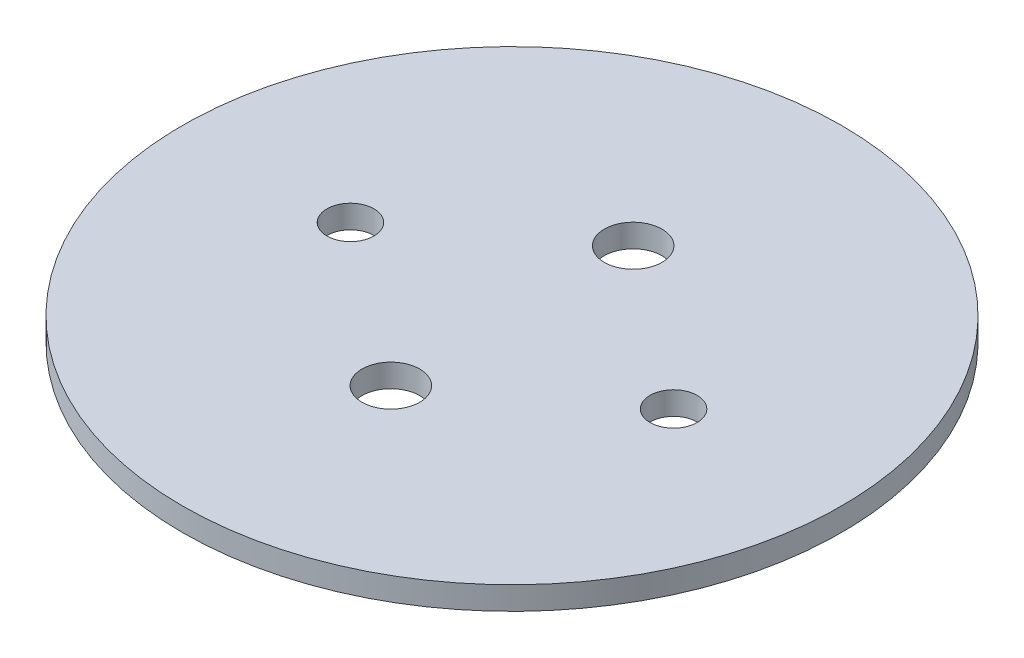
ISO-10303-21;
HEADER;
FILE_DESCRIPTION(('STEP AP214'),'2;1');
FILE_NAME('part.step','',(''),(''),'','','');
FILE_SCHEMA(('AUTOMOTIVE_DESIGN { 1 0 10303 214 1 1 1 1 }'));
ENDSEC;
DATA;
#1=APPLICATION_CONTEXT('core data for automotive mechanical design processes');
#2=APPLICATION_PROTOCOL_DEFINITION('international standard','automotive_design',2000,#1);
#3=PRODUCT_CONTEXT('',#1,'mechanical');
#4=PRODUCT('Part','Part','',(#3));
#5=PRODUCT_RELATED_PRODUCT_CATEGORY('part','',(#4));
#6=PRODUCT_DEFINITION_FORMATION('','',#4);
#7=PRODUCT_DEFINITION_CONTEXT('part definition',#1,'design');
#8=PRODUCT_DEFINITION('design','',#6,#7);
#9=PRODUCT_DEFINITION_SHAPE('','',#8);
#10=(LENGTH_UNIT() NAMED_UNIT(*) SI_UNIT(.MILLI.,.METRE.));
#11=(NAMED_UNIT(*) PLANE_ANGLE_UNIT() SI_UNIT($,.RADIAN.));
#12=(NAMED_UNIT(*) SI_UNIT($,.STERADIAN.) SOLID_ANGLE_UNIT());
#13=UNCERTAINTY_MEASURE_WITH_UNIT(LENGTH_MEASURE(1.E-05),#10,'distance_accuracy_value','');
#14=(GEOMETRIC_REPRESENTATION_CONTEXT(3) GLOBAL_UNCERTAINTY_ASSIGNED_CONTEXT((#13)) GLOBAL_UNIT_ASSIGNED_CONTEXT((#10,
#11,#12)) REPRESENTATION_CONTEXT('',''));
#15=CARTESIAN_POINT('',(0.,0.,0.));
#16=DIRECTION('',(0.,0.,1.));
#17=DIRECTION('',(1.,0.,0.));
#18=AXIS2_PLACEMENT_3D('',#15,#16,#17);
#19=CARTESIAN_POINT('',(0.,3.175,0.));
#20=DIRECTION('',(0.,1.,0.));
#21=DIRECTION('',(0.,0.,1.));
#22=AXIS2_PLACEMENT_3D('',#19,#20,#21);
#23=PLANE('',#22);
#24=CARTESIAN_POINT('',(0.,3.175,-16.66875));
#25=DIRECTION('',(0.,1.,0.));
#26=DIRECTION('',(0.,0.,1.));
#27=AXIS2_PLACEMENT_3D('',#24,#25,#26);
#28=CIRCLE('',#27,3.96874999999999);
#29=CARTESIAN_POINT('',(0.,3.175,-12.7));
#30=VERTEX_POINT('',#29);
#31=EDGE_CURVE('E63',#30,#30,#28,.T.);
#32=ORIENTED_EDGE('',*,*,#31,.F.);
#33=EDGE_LOOP('',(#32));
#34=FACE_BOUND('',#33,.T.);
#35=CARTESIAN_POINT('',(22.225,3.175,0.));
#36=DIRECTION('',(0.,1.,0.));
#37=DIRECTION('',(0.,0.,1.));
#38=AXIS2_PLACEMENT_3D('',#35,#36,#37);
#39=CIRCLE('',#38,3.2385);
#40=CARTESIAN_POINT('',(22.225,3.175,3.2385));
#41=VERTEX_POINT('',#40);
#42=EDGE_CURVE('E52',#41,#41,#39,.T.);
#43=ORIENTED_EDGE('',*,*,#42,.F.);
#44=EDGE_LOOP('',(#43));
#45=FACE_BOUND('',#44,.T.);
#46=CARTESIAN_POINT('',(0.,3.175,0.));
#47=DIRECTION('',(0.,1.,0.));
#48=DIRECTION('',(0.,0.,1.));
#49=AXIS2_PLACEMENT_3D('',#46,#47,#48);
#50=CIRCLE('',#49,45.339);
#51=CARTESIAN_POINT('',(0.,3.175,45.339));
#52=VERTEX_POINT('',#51);
#53=EDGE_CURVE('E10',#52,#52,#50,.T.);
#54=ORIENTED_EDGE('',*,*,#53,.T.);
#55=EDGE_LOOP('',(#54));
#56=FACE_BOUND('',#55,.T.);
#57=CARTESIAN_POINT('',(-22.225,3.175,0.));
#58=DIRECTION('',(0.,1.,0.));
#59=DIRECTION('',(0.,0.,1.));
#60=AXIS2_PLACEMENT_3D('',#57,#58,#59);
#61=CIRCLE('',#60,3.2385);
#62=CARTESIAN_POINT('',(-22.225,3.175,3.2385));
#63=VERTEX_POINT('',#62);
#64=EDGE_CURVE('E57',#63,#63,#61,.T.);
#65=ORIENTED_EDGE('',*,*,#64,.F.);
#66=EDGE_LOOP('',(#65));
#67=FACE_BOUND('',#66,.T.);
#68=CARTESIAN_POINT('',(0.,3.175,16.66875));
#69=DIRECTION('',(0.,1.,0.));
#70=DIRECTION('',(0.,0.,-1.));
#71=AXIS2_PLACEMENT_3D('',#68,#69,#70);
#72=CIRCLE('',#71,3.96874999999999);
#73=CARTESIAN_POINT('',(0.,3.175,12.7));
#74=VERTEX_POINT('',#73);
#75=EDGE_CURVE('E69',#74,#74,#72,.T.);
#76=ORIENTED_EDGE('',*,*,#75,.F.);
#77=EDGE_LOOP('',(#76));
#78=FACE_BOUND('',#77,.T.);
#79=ADVANCED_FACE('F41',(#34,#45,#56,#67,#78),#23,.T.);
#80=CARTESIAN_POINT('',(0.,0.,0.));
#81=DIRECTION('',(0.,1.,0.));
#82=DIRECTION('',(0.,0.,1.));
#83=AXIS2_PLACEMENT_3D('',#80,#81,#82);
#84=PLANE('',#83);
#85=CARTESIAN_POINT('',(0.,0.,0.));
#86=DIRECTION('',(0.,1.,0.));
#87=DIRECTION('',(0.,0.,1.));
#88=AXIS2_PLACEMENT_3D('',#85,#86,#87);
#89=CIRCLE('',#88,45.339);
#90=CARTESIAN_POINT('',(0.,0.,45.339));
#91=VERTEX_POINT('',#90);
#92=EDGE_CURVE('E45',#91,#91,#89,.T.);
#93=ORIENTED_EDGE('',*,*,#92,.F.);
#94=EDGE_LOOP('',(#93));
#95=FACE_BOUND('',#94,.T.);
#96=CARTESIAN_POINT('',(22.225,0.,0.));
#97=DIRECTION('',(0.,1.,0.));
#98=DIRECTION('',(0.,0.,1.));
#99=AXIS2_PLACEMENT_3D('',#96,#97,#98);
#100=CIRCLE('',#99,3.2385);
#101=CARTESIAN_POINT('',(22.225,0.,3.2385));
#102=VERTEX_POINT('',#101);
#103=EDGE_CURVE('E54',#102,#102,#100,.T.);
#104=ORIENTED_EDGE('',*,*,#103,.T.);
#105=EDGE_LOOP('',(#104));
#106=FACE_BOUND('',#105,.T.);
#107=CARTESIAN_POINT('',(-22.225,0.,0.));
#108=DIRECTION('',(0.,1.,0.));
#109=DIRECTION('',(0.,0.,1.));
#110=AXIS2_PLACEMENT_3D('',#107,#108,#109);
#111=CIRCLE('',#110,3.2385);
#112=CARTESIAN_POINT('',(-22.225,0.,3.2385));
#113=VERTEX_POINT('',#112);
#114=EDGE_CURVE('E60',#113,#113,#111,.T.);
#115=ORIENTED_EDGE('',*,*,#114,.T.);
#116=EDGE_LOOP('',(#115));
#117=FACE_BOUND('',#116,.T.);
#118=CARTESIAN_POINT('',(0.,0.,-16.66875));
#119=DIRECTION('',(0.,1.,0.));
#120=DIRECTION('',(0.,0.,1.));
#121=AXIS2_PLACEMENT_3D('',#118,#119,#120);
#122=CIRCLE('',#121,3.96874999999999);
#123=CARTESIAN_POINT('',(0.,0.,-12.7));
#124=VERTEX_POINT('',#123);
#125=EDGE_CURVE('E66',#124,#124,#122,.T.);
#126=ORIENTED_EDGE('',*,*,#125,.T.);
#127=EDGE_LOOP('',(#126));
#128=FACE_BOUND('',#127,.T.);
#129=CARTESIAN_POINT('',(0.,0.,16.66875));
#130=DIRECTION('',(0.,1.,0.));
#131=DIRECTION('',(0.,0.,-1.));
#132=AXIS2_PLACEMENT_3D('',#129,#130,#131);
#133=CIRCLE('',#132,3.96874999999999);
#134=CARTESIAN_POINT('',(0.,0.,12.7));
#135=VERTEX_POINT('',#134);
#136=EDGE_CURVE('E72',#135,#135,#133,.T.);
#137=ORIENTED_EDGE('',*,*,#136,.T.);
#138=EDGE_LOOP('',(#137));
#139=FACE_BOUND('',#138,.T.);
#140=ADVANCED_FACE('F82',(#95,#106,#117,#128,#139),#84,.F.);
#141=CARTESIAN_POINT('',(0.,3.175,0.));
#142=DIRECTION('',(0.,-1.,0.));
#143=DIRECTION('',(0.,0.,-1.));
#144=AXIS2_PLACEMENT_3D('',#141,#142,#143);
#145=CYLINDRICAL_SURFACE('',#144,45.339);
#146=ORIENTED_EDGE('',*,*,#53,.F.);
#147=EDGE_LOOP('',(#146));
#148=FACE_BOUND('',#147,.T.);
#149=ORIENTED_EDGE('',*,*,#92,.T.);
#150=EDGE_LOOP('',(#149));
#151=FACE_BOUND('',#150,.T.);
#152=ADVANCED_FACE('F43',(#148,#151),#145,.T.);
#153=CARTESIAN_POINT('',(22.225,3.175,0.));
#154=DIRECTION('',(0.,-1.,0.));
#155=DIRECTION('',(0.,0.,-1.));
#156=AXIS2_PLACEMENT_3D('',#153,#154,#155);
#157=CYLINDRICAL_SURFACE('',#156,3.2385);
#158=ORIENTED_EDGE('',*,*,#42,.T.);
#159=EDGE_LOOP('',(#158));
#160=FACE_BOUND('',#159,.T.);
#161=ORIENTED_EDGE('',*,*,#103,.F.);
#162=EDGE_LOOP('',(#161));
#163=FACE_BOUND('',#162,.T.);
#164=ADVANCED_FACE('F92',(#160,#163),#157,.F.);
#165=CARTESIAN_POINT('',(-22.225,3.175,0.));
#166=DIRECTION('',(0.,-1.,0.));
#167=DIRECTION('',(0.,0.,-1.));
#168=AXIS2_PLACEMENT_3D('',#165,#166,#167);
#169=CYLINDRICAL_SURFACE('',#168,3.2385);
#170=ORIENTED_EDGE('',*,*,#64,.T.);
#171=EDGE_LOOP('',(#170));
#172=FACE_BOUND('',#171,.T.);
#173=ORIENTED_EDGE('',*,*,#114,.F.);
#174=EDGE_LOOP('',(#173));
#175=FACE_BOUND('',#174,.T.);
#176=ADVANCED_FACE('F95',(#172,#175),#169,.F.);
#177=CARTESIAN_POINT('',(0.,3.175,-16.66875));
#178=DIRECTION('',(0.,-1.,0.));
#179=DIRECTION('',(0.,0.,-1.));
#180=AXIS2_PLACEMENT_3D('',#177,#178,#179);
#181=CYLINDRICAL_SURFACE('',#180,3.96874999999999);
#182=ORIENTED_EDGE('',*,*,#31,.T.);
#183=EDGE_LOOP('',(#182));
#184=FACE_BOUND('',#183,.T.);
#185=ORIENTED_EDGE('',*,*,#125,.F.);
#186=EDGE_LOOP('',(#185));
#187=FACE_BOUND('',#186,.T.);
#188=ADVANCED_FACE('F99',(#184,#187),#181,.F.);
#189=CARTESIAN_POINT('',(0.,3.175,16.66875));
#190=DIRECTION('',(0.,-1.,0.));
#191=DIRECTION('',(0.,0.,-1.));
#192=AXIS2_PLACEMENT_3D('',#189,#190,#191);
#193=CYLINDRICAL_SURFACE('',#192,3.96874999999999);
#194=ORIENTED_EDGE('',*,*,#75,.T.);
#195=EDGE_LOOP('',(#194));
#196=FACE_BOUND('',#195,.T.);
#197=ORIENTED_EDGE('',*,*,#136,.F.);
#198=EDGE_LOOP('',(#197));
#199=FACE_BOUND('',#198,.T.);
#200=ADVANCED_FACE('F78',(#196,#199),#193,.F.);
#201=CLOSED_SHELL('',(#79,#140,#152,#164,#176,#188,#200));
#202=MANIFOLD_SOLID_BREP('B2',#201);
#203=ADVANCED_BREP_SHAPE_REPRESENTATION('',(#18,#202),#14);
#204=SHAPE_DEFINITION_REPRESENTATION(#9,#203);
ENDSEC;
END-ISO-10303-21;
